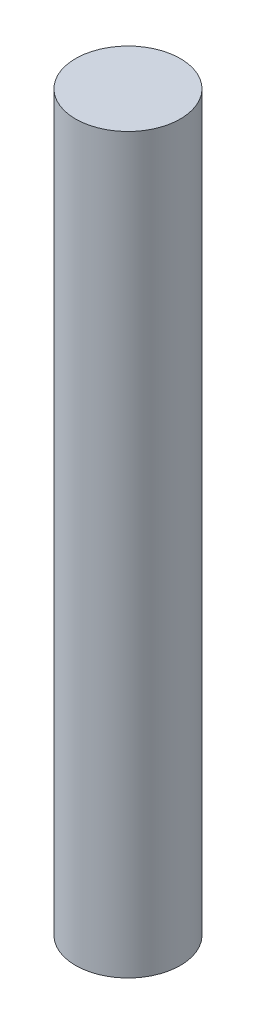
ISO-10303-21;
HEADER;
FILE_DESCRIPTION(('STEP AP214'),'2;1');
FILE_NAME('part.step','',(''),(''),'','','');
FILE_SCHEMA(('AUTOMOTIVE_DESIGN { 1 0 10303 214 1 1 1 1 }'));
ENDSEC;
DATA;
#1=APPLICATION_CONTEXT('core data for automotive mechanical design processes');
#2=APPLICATION_PROTOCOL_DEFINITION('international standard','automotive_design',2000,#1);
#3=PRODUCT_CONTEXT('',#1,'mechanical');
#4=PRODUCT('Part','Part','',(#3));
#5=PRODUCT_RELATED_PRODUCT_CATEGORY('part','',(#4));
#6=PRODUCT_DEFINITION_FORMATION('','',#4);
#7=PRODUCT_DEFINITION_CONTEXT('part definition',#1,'design');
#8=PRODUCT_DEFINITION('design','',#6,#7);
#9=PRODUCT_DEFINITION_SHAPE('','',#8);
#10=(LENGTH_UNIT() NAMED_UNIT(*) SI_UNIT(.MILLI.,.METRE.));
#11=(NAMED_UNIT(*) PLANE_ANGLE_UNIT() SI_UNIT($,.RADIAN.));
#12=(NAMED_UNIT(*) SI_UNIT($,.STERADIAN.) SOLID_ANGLE_UNIT());
#13=UNCERTAINTY_MEASURE_WITH_UNIT(LENGTH_MEASURE(1.E-05),#10,'distance_accuracy_value','');
#14=(GEOMETRIC_REPRESENTATION_CONTEXT(3) GLOBAL_UNCERTAINTY_ASSIGNED_CONTEXT((#13)) GLOBAL_UNIT_ASSIGNED_CONTEXT((#10,
#11,#12)) REPRESENTATION_CONTEXT('',''));
#15=CARTESIAN_POINT('',(0.,0.,0.));
#16=DIRECTION('',(0.,0.,1.));
#17=DIRECTION('',(1.,0.,0.));
#18=AXIS2_PLACEMENT_3D('',#15,#16,#17);
#19=CARTESIAN_POINT('',(0.,177.8,0.));
#20=DIRECTION('',(0.,-1.,0.));
#21=DIRECTION('',(0.,0.,-1.));
#22=AXIS2_PLACEMENT_3D('',#19,#20,#21);
#23=CYLINDRICAL_SURFACE('',#22,12.7);
#24=CARTESIAN_POINT('',(0.,177.8,0.));
#25=DIRECTION('',(0.,1.,0.));
#26=DIRECTION('',(0.,0.,1.));
#27=AXIS2_PLACEMENT_3D('',#24,#25,#26);
#28=CIRCLE('',#27,12.7);
#29=CARTESIAN_POINT('',(0.,177.8,12.7));
#30=VERTEX_POINT('',#29);
#31=EDGE_CURVE('E10',#30,#30,#28,.T.);
#32=ORIENTED_EDGE('',*,*,#31,.F.);
#33=EDGE_LOOP('',(#32));
#34=FACE_BOUND('',#33,.T.);
#35=CARTESIAN_POINT('',(0.,0.,0.));
#36=DIRECTION('',(0.,1.,0.));
#37=DIRECTION('',(0.,0.,1.));
#38=AXIS2_PLACEMENT_3D('',#35,#36,#37);
#39=CIRCLE('',#38,12.7);
#40=CARTESIAN_POINT('',(0.,0.,12.7));
#41=VERTEX_POINT('',#40);
#42=EDGE_CURVE('E18',#41,#41,#39,.T.);
#43=ORIENTED_EDGE('',*,*,#42,.T.);
#44=EDGE_LOOP('',(#43));
#45=FACE_BOUND('',#44,.T.);
#46=ADVANCED_FACE('F15',(#34,#45),#23,.T.);
#47=CARTESIAN_POINT('',(0.,177.8,0.));
#48=DIRECTION('',(0.,1.,0.));
#49=DIRECTION('',(0.,0.,1.));
#50=AXIS2_PLACEMENT_3D('',#47,#48,#49);
#51=PLANE('',#50);
#52=ORIENTED_EDGE('',*,*,#31,.T.);
#53=EDGE_LOOP('',(#52));
#54=FACE_BOUND('',#53,.T.);
#55=ADVANCED_FACE('F30',(#54),#51,.T.);
#56=CARTESIAN_POINT('',(0.,0.,0.));
#57=DIRECTION('',(0.,1.,0.));
#58=DIRECTION('',(0.,0.,1.));
#59=AXIS2_PLACEMENT_3D('',#56,#57,#58);
#60=PLANE('',#59);
#61=ORIENTED_EDGE('',*,*,#42,.F.);
#62=EDGE_LOOP('',(#61));
#63=FACE_BOUND('',#62,.T.);
#64=ADVANCED_FACE('F28',(#63),#60,.F.);
#65=CLOSED_SHELL('',(#46,#55,#64));
#66=MANIFOLD_SOLID_BREP('B1',#65);
#67=ADVANCED_BREP_SHAPE_REPRESENTATION('',(#18,#66),#14);
#68=SHAPE_DEFINITION_REPRESENTATION(#9,#67);
ENDSEC;
END-ISO-10303-21;
